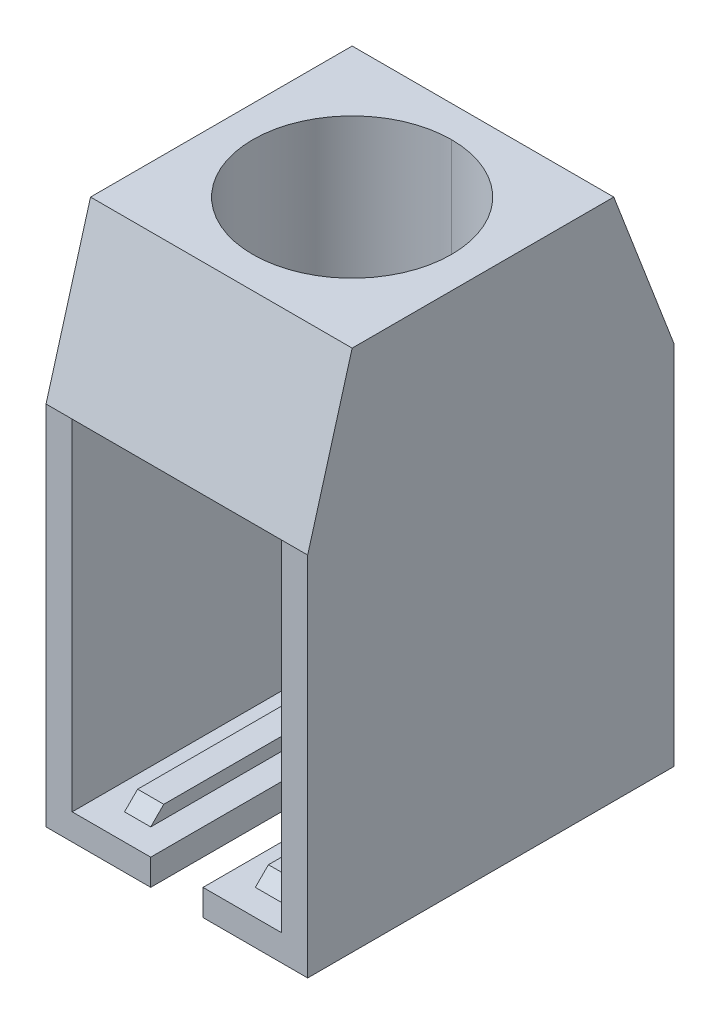
ISO-10303-21;
HEADER;
FILE_DESCRIPTION(('STEP AP214'),'2;1');
FILE_NAME('part.step','',(''),(''),'','','');
FILE_SCHEMA(('AUTOMOTIVE_DESIGN { 1 0 10303 214 1 1 1 1 }'));
ENDSEC;
DATA;
#1=APPLICATION_CONTEXT('core data for automotive mechanical design processes');
#2=APPLICATION_PROTOCOL_DEFINITION('international standard','automotive_design',2000,#1);
#3=PRODUCT_CONTEXT('',#1,'mechanical');
#4=PRODUCT('Part','Part','',(#3));
#5=PRODUCT_RELATED_PRODUCT_CATEGORY('part','',(#4));
#6=PRODUCT_DEFINITION_FORMATION('','',#4);
#7=PRODUCT_DEFINITION_CONTEXT('part definition',#1,'design');
#8=PRODUCT_DEFINITION('design','',#6,#7);
#9=PRODUCT_DEFINITION_SHAPE('','',#8);
#10=(LENGTH_UNIT() NAMED_UNIT(*) SI_UNIT(.MILLI.,.METRE.));
#11=(NAMED_UNIT(*) PLANE_ANGLE_UNIT() SI_UNIT($,.RADIAN.));
#12=(NAMED_UNIT(*) SI_UNIT($,.STERADIAN.) SOLID_ANGLE_UNIT());
#13=UNCERTAINTY_MEASURE_WITH_UNIT(LENGTH_MEASURE(1.E-05),#10,'distance_accuracy_value','');
#14=(GEOMETRIC_REPRESENTATION_CONTEXT(3) GLOBAL_UNCERTAINTY_ASSIGNED_CONTEXT((#13)) GLOBAL_UNIT_ASSIGNED_CONTEXT((#10,
#11,#12)) REPRESENTATION_CONTEXT('',''));
#15=CARTESIAN_POINT('',(0.,0.,0.));
#16=DIRECTION('',(0.,0.,1.));
#17=DIRECTION('',(1.,0.,0.));
#18=AXIS2_PLACEMENT_3D('',#15,#16,#17);
#19=CARTESIAN_POINT('',(-2.,6.5,3.));
#20=DIRECTION('',(0.,0.707106781186548,-0.707106781186547));
#21=DIRECTION('',(-1.,0.,0.));
#22=AXIS2_PLACEMENT_3D('',#19,#20,#21);
#23=PLANE('',#22);
#24=DIRECTION('',(0.,-0.707106781186547,-0.707106781186548));
#25=VECTOR('',#24,1.);
#26=CARTESIAN_POINT('',(2.,-0.355551275463989,-3.85555127546401));
#27=LINE('',#26,#25);
#28=CARTESIAN_POINT('',(2.,7.,3.5));
#29=VERTEX_POINT('',#28);
#30=CARTESIAN_POINT('',(2.,6.5,3.));
#31=VERTEX_POINT('',#30);
#32=EDGE_CURVE('E352',#29,#31,#27,.T.);
#33=ORIENTED_EDGE('',*,*,#32,.F.);
#34=DIRECTION('',(1.,0.,0.));
#35=VECTOR('',#34,1.);
#36=CARTESIAN_POINT('',(-2.5,7.,3.5));
#37=LINE('',#36,#35);
#38=CARTESIAN_POINT('',(-2.,7.,3.5));
#39=VERTEX_POINT('',#38);
#40=EDGE_CURVE('E348',#39,#29,#37,.T.);
#41=ORIENTED_EDGE('',*,*,#40,.F.);
#42=DIRECTION('',(0.,0.707106781186547,0.707106781186548));
#43=VECTOR('',#42,1.);
#44=CARTESIAN_POINT('',(-2.,-0.355551275463989,-3.85555127546401));
#45=LINE('',#44,#43);
#46=CARTESIAN_POINT('',(-2.,6.5,3.));
#47=VERTEX_POINT('',#46);
#48=EDGE_CURVE('E360',#47,#39,#45,.T.);
#49=ORIENTED_EDGE('',*,*,#48,.F.);
#50=DIRECTION('',(-1.,0.,0.));
#51=VECTOR('',#50,1.);
#52=CARTESIAN_POINT('',(-2.,6.5,3.));
#53=LINE('',#52,#51);
#54=EDGE_CURVE('E143',#31,#47,#53,.T.);
#55=ORIENTED_EDGE('',*,*,#54,.F.);
#56=EDGE_LOOP('',(#33,#41,#49,#55));
#57=FACE_BOUND('',#56,.T.);
#58=ADVANCED_FACE('F17',(#57),#23,.F.);
#59=CARTESIAN_POINT('',(0.,0.75,2.75));
#60=DIRECTION('',(0.,0.707106781186545,0.70710678118655));
#61=DIRECTION('',(1.,0.,0.));
#62=AXIS2_PLACEMENT_3D('',#59,#60,#61);
#63=PLANE('',#62);
#64=DIRECTION('',(0.,0.70710678118655,-0.707106781186545));
#65=VECTOR('',#64,1.);
#66=CARTESIAN_POINT('',(-1.5,0.749999999999976,2.75));
#67=LINE('',#66,#65);
#68=CARTESIAN_POINT('',(-1.5,0.5,3.));
#69=VERTEX_POINT('',#68);
#70=CARTESIAN_POINT('',(-1.5,0.75,2.75));
#71=VERTEX_POINT('',#70);
#72=EDGE_CURVE('E333',#69,#71,#67,.T.);
#73=ORIENTED_EDGE('',*,*,#72,.F.);
#74=DIRECTION('',(1.,0.,0.));
#75=VECTOR('',#74,1.);
#76=CARTESIAN_POINT('',(0.,0.5,3.));
#77=LINE('',#76,#75);
#78=CARTESIAN_POINT('',(-1.,0.5,3.));
#79=VERTEX_POINT('',#78);
#80=EDGE_CURVE('E537',#69,#79,#77,.T.);
#81=ORIENTED_EDGE('',*,*,#80,.T.);
#82=DIRECTION('',(0.,-0.70710678118655,0.707106781186545));
#83=VECTOR('',#82,1.);
#84=CARTESIAN_POINT('',(-1.,2.125,1.375));
#85=LINE('',#84,#83);
#86=CARTESIAN_POINT('',(-1.,0.75,2.75));
#87=VERTEX_POINT('',#86);
#88=EDGE_CURVE('E167',#87,#79,#85,.T.);
#89=ORIENTED_EDGE('',*,*,#88,.F.);
#90=DIRECTION('',(1.,0.,0.));
#91=VECTOR('',#90,1.);
#92=CARTESIAN_POINT('',(-1.,0.75,2.75));
#93=LINE('',#92,#91);
#94=EDGE_CURVE('E370',#71,#87,#93,.T.);
#95=ORIENTED_EDGE('',*,*,#94,.F.);
#96=EDGE_LOOP('',(#73,#81,#89,#95));
#97=FACE_BOUND('',#96,.T.);
#98=ADVANCED_FACE('F407',(#97),#63,.T.);
#99=CARTESIAN_POINT('',(0.,0.75,2.75));
#100=DIRECTION('',(0.,0.707106781186545,0.70710678118655));
#101=DIRECTION('',(1.,0.,0.));
#102=AXIS2_PLACEMENT_3D('',#99,#100,#101);
#103=PLANE('',#102);
#104=DIRECTION('',(0.,0.70710678118655,-0.707106781186545));
#105=VECTOR('',#104,1.);
#106=CARTESIAN_POINT('',(1.,0.75,2.75));
#107=LINE('',#106,#105);
#108=CARTESIAN_POINT('',(1.,0.5,3.));
#109=VERTEX_POINT('',#108);
#110=CARTESIAN_POINT('',(1.,0.75,2.75));
#111=VERTEX_POINT('',#110);
#112=EDGE_CURVE('E376',#109,#111,#107,.T.);
#113=ORIENTED_EDGE('',*,*,#112,.F.);
#114=DIRECTION('',(1.,0.,0.));
#115=VECTOR('',#114,1.);
#116=CARTESIAN_POINT('',(0.,0.5,3.));
#117=LINE('',#116,#115);
#118=CARTESIAN_POINT('',(1.5,0.5,3.));
#119=VERTEX_POINT('',#118);
#120=EDGE_CURVE('E526',#109,#119,#117,.T.);
#121=ORIENTED_EDGE('',*,*,#120,.T.);
#122=DIRECTION('',(0.,-0.70710678118655,0.707106781186545));
#123=VECTOR('',#122,1.);
#124=CARTESIAN_POINT('',(1.5,2.125,1.375));
#125=LINE('',#124,#123);
#126=CARTESIAN_POINT('',(1.5,0.75,2.75));
#127=VERTEX_POINT('',#126);
#128=EDGE_CURVE('E374',#127,#119,#125,.T.);
#129=ORIENTED_EDGE('',*,*,#128,.F.);
#130=DIRECTION('',(1.,0.,0.));
#131=VECTOR('',#130,1.);
#132=CARTESIAN_POINT('',(1.5,0.75,2.75));
#133=LINE('',#132,#131);
#134=EDGE_CURVE('E11',#111,#127,#133,.T.);
#135=ORIENTED_EDGE('',*,*,#134,.F.);
#136=EDGE_LOOP('',(#113,#121,#129,#135));
#137=FACE_BOUND('',#136,.T.);
#138=ADVANCED_FACE('F403',(#137),#103,.T.);
#139=CARTESIAN_POINT('',(0.,0.75,0.));
#140=DIRECTION('',(0.,1.,0.));
#141=DIRECTION('',(1.,0.,0.));
#142=AXIS2_PLACEMENT_3D('',#139,#140,#141);
#143=PLANE('',#142);
#144=DIRECTION('',(0.,0.,1.));
#145=VECTOR('',#144,1.);
#146=CARTESIAN_POINT('',(1.,0.75,0.));
#147=LINE('',#146,#145);
#148=CARTESIAN_POINT('',(1.,0.75,-3.));
#149=VERTEX_POINT('',#148);
#150=EDGE_CURVE('E20',#149,#111,#147,.T.);
#151=ORIENTED_EDGE('',*,*,#150,.T.);
#152=ORIENTED_EDGE('',*,*,#134,.T.);
#153=DIRECTION('',(0.,0.,1.));
#154=VECTOR('',#153,1.);
#155=CARTESIAN_POINT('',(1.5,0.75,0.));
#156=LINE('',#155,#154);
#157=CARTESIAN_POINT('',(1.5,0.75,-3.));
#158=VERTEX_POINT('',#157);
#159=EDGE_CURVE('E373',#158,#127,#156,.T.);
#160=ORIENTED_EDGE('',*,*,#159,.F.);
#161=DIRECTION('',(-1.,0.,0.));
#162=VECTOR('',#161,1.);
#163=CARTESIAN_POINT('',(0.,0.75,-3.));
#164=LINE('',#163,#162);
#165=EDGE_CURVE('E290',#158,#149,#164,.T.);
#166=ORIENTED_EDGE('',*,*,#165,.T.);
#167=EDGE_LOOP('',(#151,#152,#160,#166));
#168=FACE_BOUND('',#167,.T.);
#169=ADVANCED_FACE('F386',(#168),#143,.T.);
#170=CARTESIAN_POINT('',(1.,0.75,0.));
#171=DIRECTION('',(1.,0.,0.));
#172=DIRECTION('',(0.,0.,-1.));
#173=AXIS2_PLACEMENT_3D('',#170,#171,#172);
#174=PLANE('',#173);
#175=DIRECTION('',(0.,0.,1.));
#176=VECTOR('',#175,1.);
#177=CARTESIAN_POINT('',(1.,0.5,0.));
#178=LINE('',#177,#176);
#179=CARTESIAN_POINT('',(1.,0.5,-3.));
#180=VERTEX_POINT('',#179);
#181=EDGE_CURVE('E390',#180,#109,#178,.T.);
#182=ORIENTED_EDGE('',*,*,#181,.T.);
#183=ORIENTED_EDGE('',*,*,#112,.T.);
#184=ORIENTED_EDGE('',*,*,#150,.F.);
#185=DIRECTION('',(0.,-1.,0.));
#186=VECTOR('',#185,1.);
#187=CARTESIAN_POINT('',(1.,0.75,-3.));
#188=LINE('',#187,#186);
#189=EDGE_CURVE('E191',#149,#180,#188,.T.);
#190=ORIENTED_EDGE('',*,*,#189,.T.);
#191=EDGE_LOOP('',(#182,#183,#184,#190));
#192=FACE_BOUND('',#191,.T.);
#193=ADVANCED_FACE('F388',(#192),#174,.F.);
#194=CARTESIAN_POINT('',(1.5,0.75,0.));
#195=DIRECTION('',(1.,0.,0.));
#196=DIRECTION('',(0.,0.,-1.));
#197=AXIS2_PLACEMENT_3D('',#194,#195,#196);
#198=PLANE('',#197);
#199=ORIENTED_EDGE('',*,*,#159,.T.);
#200=ORIENTED_EDGE('',*,*,#128,.T.);
#201=DIRECTION('',(0.,0.,1.));
#202=VECTOR('',#201,1.);
#203=CARTESIAN_POINT('',(1.5,0.5,0.));
#204=LINE('',#203,#202);
#205=CARTESIAN_POINT('',(1.5,0.5,-3.));
#206=VERTEX_POINT('',#205);
#207=EDGE_CURVE('E475',#206,#119,#204,.T.);
#208=ORIENTED_EDGE('',*,*,#207,.F.);
#209=DIRECTION('',(0.,-1.,0.));
#210=VECTOR('',#209,1.);
#211=CARTESIAN_POINT('',(1.5,0.75,-3.));
#212=LINE('',#211,#210);
#213=EDGE_CURVE('E571',#158,#206,#212,.T.);
#214=ORIENTED_EDGE('',*,*,#213,.F.);
#215=EDGE_LOOP('',(#199,#200,#208,#214));
#216=FACE_BOUND('',#215,.T.);
#217=ADVANCED_FACE('F393',(#216),#198,.T.);
#218=CARTESIAN_POINT('',(0.,0.75,0.));
#219=DIRECTION('',(0.,1.,0.));
#220=DIRECTION('',(1.,0.,0.));
#221=AXIS2_PLACEMENT_3D('',#218,#219,#220);
#222=PLANE('',#221);
#223=DIRECTION('',(0.,0.,1.));
#224=VECTOR('',#223,1.);
#225=CARTESIAN_POINT('',(-1.5,0.75,0.));
#226=LINE('',#225,#224);
#227=CARTESIAN_POINT('',(-1.5,0.75,-3.));
#228=VERTEX_POINT('',#227);
#229=EDGE_CURVE('E328',#228,#71,#226,.T.);
#230=ORIENTED_EDGE('',*,*,#229,.T.);
#231=ORIENTED_EDGE('',*,*,#94,.T.);
#232=DIRECTION('',(0.,0.,1.));
#233=VECTOR('',#232,1.);
#234=CARTESIAN_POINT('',(-1.,0.75,0.));
#235=LINE('',#234,#233);
#236=CARTESIAN_POINT('',(-1.,0.75,-3.));
#237=VERTEX_POINT('',#236);
#238=EDGE_CURVE('E332',#237,#87,#235,.T.);
#239=ORIENTED_EDGE('',*,*,#238,.F.);
#240=DIRECTION('',(-1.,0.,0.));
#241=VECTOR('',#240,1.);
#242=CARTESIAN_POINT('',(0.,0.75,-3.));
#243=LINE('',#242,#241);
#244=EDGE_CURVE('E454',#237,#228,#243,.T.);
#245=ORIENTED_EDGE('',*,*,#244,.T.);
#246=EDGE_LOOP('',(#230,#231,#239,#245));
#247=FACE_BOUND('',#246,.T.);
#248=ADVANCED_FACE('F400',(#247),#222,.T.);
#249=CARTESIAN_POINT('',(-1.,0.75,0.));
#250=DIRECTION('',(1.,0.,0.));
#251=DIRECTION('',(0.,0.,1.));
#252=AXIS2_PLACEMENT_3D('',#249,#250,#251);
#253=PLANE('',#252);
#254=ORIENTED_EDGE('',*,*,#238,.T.);
#255=ORIENTED_EDGE('',*,*,#88,.T.);
#256=DIRECTION('',(0.,0.,1.));
#257=VECTOR('',#256,1.);
#258=CARTESIAN_POINT('',(-1.,0.5,0.));
#259=LINE('',#258,#257);
#260=CARTESIAN_POINT('',(-1.,0.5,-3.));
#261=VERTEX_POINT('',#260);
#262=EDGE_CURVE('E530',#261,#79,#259,.T.);
#263=ORIENTED_EDGE('',*,*,#262,.F.);
#264=DIRECTION('',(0.,-1.,0.));
#265=VECTOR('',#264,1.);
#266=CARTESIAN_POINT('',(-1.,0.75,-3.));
#267=LINE('',#266,#265);
#268=EDGE_CURVE('E179',#237,#261,#267,.T.);
#269=ORIENTED_EDGE('',*,*,#268,.F.);
#270=EDGE_LOOP('',(#254,#255,#263,#269));
#271=FACE_BOUND('',#270,.T.);
#272=ADVANCED_FACE('F654',(#271),#253,.T.);
#273=CARTESIAN_POINT('',(-1.5,0.75,0.));
#274=DIRECTION('',(1.,0.,0.));
#275=DIRECTION('',(0.,0.,-1.));
#276=AXIS2_PLACEMENT_3D('',#273,#274,#275);
#277=PLANE('',#276);
#278=DIRECTION('',(0.,0.,1.));
#279=VECTOR('',#278,1.);
#280=CARTESIAN_POINT('',(-1.5,0.5,0.));
#281=LINE('',#280,#279);
#282=CARTESIAN_POINT('',(-1.5,0.5,-3.));
#283=VERTEX_POINT('',#282);
#284=EDGE_CURVE('E540',#283,#69,#281,.T.);
#285=ORIENTED_EDGE('',*,*,#284,.T.);
#286=ORIENTED_EDGE('',*,*,#72,.T.);
#287=ORIENTED_EDGE('',*,*,#229,.F.);
#288=DIRECTION('',(0.,-1.,0.));
#289=VECTOR('',#288,1.);
#290=CARTESIAN_POINT('',(-1.5,0.75,-3.));
#291=LINE('',#290,#289);
#292=EDGE_CURVE('E451',#228,#283,#291,.T.);
#293=ORIENTED_EDGE('',*,*,#292,.T.);
#294=EDGE_LOOP('',(#285,#286,#287,#293));
#295=FACE_BOUND('',#294,.T.);
#296=ADVANCED_FACE('F605',(#295),#277,.F.);
#297=CARTESIAN_POINT('',(-0.5,10.001,3.5));
#298=DIRECTION('',(-1.,0.,0.));
#299=DIRECTION('',(0.,0.,1.));
#300=AXIS2_PLACEMENT_3D('',#297,#298,#299);
#301=PLANE('',#300);
#302=DIRECTION('',(0.,0.,1.));
#303=VECTOR('',#302,1.);
#304=CARTESIAN_POINT('',(-0.5,0.5,3.5));
#305=LINE('',#304,#303);
#306=CARTESIAN_POINT('',(-0.5,0.5,0.15));
#307=VERTEX_POINT('',#306);
#308=CARTESIAN_POINT('',(-0.5,0.5,3.5));
#309=VERTEX_POINT('',#308);
#310=EDGE_CURVE('E556',#307,#309,#305,.T.);
#311=ORIENTED_EDGE('',*,*,#310,.T.);
#312=DIRECTION('',(0.,-1.,0.));
#313=VECTOR('',#312,1.);
#314=CARTESIAN_POINT('',(-0.5,10.001,3.5));
#315=LINE('',#314,#313);
#316=CARTESIAN_POINT('',(-0.5,0.,3.5));
#317=VERTEX_POINT('',#316);
#318=EDGE_CURVE('E483',#309,#317,#315,.T.);
#319=ORIENTED_EDGE('',*,*,#318,.T.);
#320=DIRECTION('',(0.,0.,-1.));
#321=VECTOR('',#320,1.);
#322=CARTESIAN_POINT('',(-0.5,0.,3.5));
#323=LINE('',#322,#321);
#324=CARTESIAN_POINT('',(-0.5,0.,0.15));
#325=VERTEX_POINT('',#324);
#326=EDGE_CURVE('E344',#317,#325,#323,.T.);
#327=ORIENTED_EDGE('',*,*,#326,.T.);
#328=DIRECTION('',(0.,-1.,0.));
#329=VECTOR('',#328,1.);
#330=CARTESIAN_POINT('',(-0.5,10.001,0.15));
#331=LINE('',#330,#329);
#332=EDGE_CURVE('E367',#307,#325,#331,.T.);
#333=ORIENTED_EDGE('',*,*,#332,.F.);
#334=EDGE_LOOP('',(#311,#319,#327,#333));
#335=FACE_BOUND('',#334,.T.);
#336=ADVANCED_FACE('F601',(#335),#301,.F.);
#337=CARTESIAN_POINT('',(0.,10.001,0.15));
#338=DIRECTION('',(0.,-1.,0.));
#339=DIRECTION('',(0.,0.,-1.));
#340=AXIS2_PLACEMENT_3D('',#337,#338,#339);
#341=CYLINDRICAL_SURFACE('',#340,0.5);
#342=DIRECTION('',(0.,-1.,0.));
#343=VECTOR('',#342,1.);
#344=CARTESIAN_POINT('',(0.,10.001,-0.35));
#345=LINE('',#344,#343);
#346=CARTESIAN_POINT('',(0.,0.5,-0.35));
#347=VERTEX_POINT('',#346);
#348=CARTESIAN_POINT('',(0.,0.,-0.35));
#349=VERTEX_POINT('',#348);
#350=EDGE_CURVE('E676',#347,#349,#345,.T.);
#351=ORIENTED_EDGE('',*,*,#350,.F.);
#352=CARTESIAN_POINT('',(0.,0.5,0.15));
#353=DIRECTION('',(0.,1.,0.));
#354=DIRECTION('',(0.,0.,-1.));
#355=AXIS2_PLACEMENT_3D('',#352,#353,#354);
#356=CIRCLE('',#355,0.5);
#357=EDGE_CURVE('E562',#347,#307,#356,.T.);
#358=ORIENTED_EDGE('',*,*,#357,.T.);
#359=ORIENTED_EDGE('',*,*,#332,.T.);
#360=CARTESIAN_POINT('',(0.,0.,0.15));
#361=DIRECTION('',(0.,-1.,0.));
#362=DIRECTION('',(0.,0.,-1.));
#363=AXIS2_PLACEMENT_3D('',#360,#361,#362);
#364=CIRCLE('',#363,0.5);
#365=EDGE_CURVE('E341',#325,#349,#364,.T.);
#366=ORIENTED_EDGE('',*,*,#365,.T.);
#367=EDGE_LOOP('',(#351,#358,#359,#366));
#368=FACE_BOUND('',#367,.T.);
#369=ADVANCED_FACE('F604',(#368),#341,.F.);
#370=CARTESIAN_POINT('',(0.5,10.001,0.15));
#371=DIRECTION('',(1.,0.,0.));
#372=DIRECTION('',(0.,0.,1.));
#373=AXIS2_PLACEMENT_3D('',#370,#371,#372);
#374=PLANE('',#373);
#375=DIRECTION('',(0.,0.,-1.));
#376=VECTOR('',#375,1.);
#377=CARTESIAN_POINT('',(0.5,0.5,0.15));
#378=LINE('',#377,#376);
#379=CARTESIAN_POINT('',(0.5,0.5,3.5));
#380=VERTEX_POINT('',#379);
#381=CARTESIAN_POINT('',(0.5,0.5,0.15));
#382=VERTEX_POINT('',#381);
#383=EDGE_CURVE('E557',#380,#382,#378,.T.);
#384=ORIENTED_EDGE('',*,*,#383,.T.);
#385=DIRECTION('',(0.,-1.,0.));
#386=VECTOR('',#385,1.);
#387=CARTESIAN_POINT('',(0.5,10.001,0.15));
#388=LINE('',#387,#386);
#389=CARTESIAN_POINT('',(0.5,0.,0.15));
#390=VERTEX_POINT('',#389);
#391=EDGE_CURVE('E484',#382,#390,#388,.T.);
#392=ORIENTED_EDGE('',*,*,#391,.T.);
#393=DIRECTION('',(0.,0.,1.));
#394=VECTOR('',#393,1.);
#395=CARTESIAN_POINT('',(0.5,0.,0.15));
#396=LINE('',#395,#394);
#397=CARTESIAN_POINT('',(0.5,0.,3.5));
#398=VERTEX_POINT('',#397);
#399=EDGE_CURVE('E338',#390,#398,#396,.T.);
#400=ORIENTED_EDGE('',*,*,#399,.T.);
#401=DIRECTION('',(0.,-1.,0.));
#402=VECTOR('',#401,1.);
#403=CARTESIAN_POINT('',(0.5,10.001,3.5));
#404=LINE('',#403,#402);
#405=EDGE_CURVE('E310',#380,#398,#404,.T.);
#406=ORIENTED_EDGE('',*,*,#405,.F.);
#407=EDGE_LOOP('',(#384,#392,#400,#406));
#408=FACE_BOUND('',#407,.T.);
#409=ADVANCED_FACE('F617',(#408),#374,.F.);
#410=CARTESIAN_POINT('',(0.,-0.000999999999999265,0.15));
#411=DIRECTION('',(0.,1.,0.));
#412=DIRECTION('',(0.,0.,1.));
#413=AXIS2_PLACEMENT_3D('',#410,#411,#412);
#414=CYLINDRICAL_SURFACE('',#413,1.9);
#415=DIRECTION('',(0.,1.,0.));
#416=VECTOR('',#415,1.);
#417=CARTESIAN_POINT('',(0.,-0.000999999999999265,-1.75));
#418=LINE('',#417,#416);
#419=CARTESIAN_POINT('',(0.,6.5,-1.75));
#420=VERTEX_POINT('',#419);
#421=CARTESIAN_POINT('',(0.,10.,-1.75));
#422=VERTEX_POINT('',#421);
#423=EDGE_CURVE('E492',#420,#422,#418,.T.);
#424=ORIENTED_EDGE('',*,*,#423,.F.);
#425=CARTESIAN_POINT('',(0.,6.5,0.15));
#426=DIRECTION('',(0.,-1.,0.));
#427=DIRECTION('',(0.,0.,1.));
#428=AXIS2_PLACEMENT_3D('',#425,#426,#427);
#429=CIRCLE('',#428,1.9);
#430=CARTESIAN_POINT('',(0.,6.5,2.05));
#431=VERTEX_POINT('',#430);
#432=EDGE_CURVE('E363',#420,#431,#429,.T.);
#433=ORIENTED_EDGE('',*,*,#432,.T.);
#434=DIRECTION('',(0.,1.,0.));
#435=VECTOR('',#434,1.);
#436=CARTESIAN_POINT('',(0.,-0.000999999999999265,2.05));
#437=LINE('',#436,#435);
#438=CARTESIAN_POINT('',(0.,10.,2.05));
#439=VERTEX_POINT('',#438);
#440=EDGE_CURVE('E497',#431,#439,#437,.T.);
#441=ORIENTED_EDGE('',*,*,#440,.T.);
#442=CARTESIAN_POINT('',(0.,10.,0.15));
#443=DIRECTION('',(0.,1.,0.));
#444=DIRECTION('',(0.,0.,1.));
#445=AXIS2_PLACEMENT_3D('',#442,#443,#444);
#446=CIRCLE('',#445,1.9);
#447=EDGE_CURVE('E268',#439,#422,#446,.T.);
#448=ORIENTED_EDGE('',*,*,#447,.T.);
#449=EDGE_LOOP('',(#424,#433,#441,#448));
#450=FACE_BOUND('',#449,.T.);
#451=ADVANCED_FACE('F644',(#450),#414,.F.);
#452=CARTESIAN_POINT('',(-2.,6.5,-10.711102550928));
#453=DIRECTION('',(0.,1.,0.));
#454=DIRECTION('',(1.,0.,0.));
#455=AXIS2_PLACEMENT_3D('',#452,#453,#454);
#456=PLANE('',#455);
#457=CARTESIAN_POINT('',(0.,6.5,0.15));
#458=DIRECTION('',(0.,-1.,0.));
#459=DIRECTION('',(0.,0.,1.));
#460=AXIS2_PLACEMENT_3D('',#457,#458,#459);
#461=CIRCLE('',#460,1.9);
#462=EDGE_CURVE('E488',#431,#420,#461,.T.);
#463=ORIENTED_EDGE('',*,*,#462,.F.);
#464=ORIENTED_EDGE('',*,*,#432,.F.);
#465=EDGE_LOOP('',(#463,#464));
#466=FACE_BOUND('',#465,.T.);
#467=DIRECTION('',(0.,0.,1.));
#468=VECTOR('',#467,1.);
#469=CARTESIAN_POINT('',(2.,6.5,-10.711102550928));
#470=LINE('',#469,#468);
#471=CARTESIAN_POINT('',(2.,6.5,-3.));
#472=VERTEX_POINT('',#471);
#473=EDGE_CURVE('E294',#472,#31,#470,.T.);
#474=ORIENTED_EDGE('',*,*,#473,.T.);
#475=ORIENTED_EDGE('',*,*,#54,.T.);
#476=DIRECTION('',(0.,0.,1.));
#477=VECTOR('',#476,1.);
#478=CARTESIAN_POINT('',(-2.,6.5,-10.711102550928));
#479=LINE('',#478,#477);
#480=CARTESIAN_POINT('',(-2.,6.5,-3.));
#481=VERTEX_POINT('',#480);
#482=EDGE_CURVE('E356',#481,#47,#479,.T.);
#483=ORIENTED_EDGE('',*,*,#482,.F.);
#484=DIRECTION('',(1.,0.,0.));
#485=VECTOR('',#484,1.);
#486=CARTESIAN_POINT('',(-2.,6.5,-3.));
#487=LINE('',#486,#485);
#488=EDGE_CURVE('E443',#481,#472,#487,.T.);
#489=ORIENTED_EDGE('',*,*,#488,.T.);
#490=EDGE_LOOP('',(#474,#475,#483,#489));
#491=FACE_BOUND('',#490,.T.);
#492=ADVANCED_FACE('F621',(#466,#491),#456,.F.);
#493=CARTESIAN_POINT('',(-2.,6.5,-10.711102550928));
#494=DIRECTION('',(-1.,0.,0.));
#495=DIRECTION('',(0.,0.,1.));
#496=AXIS2_PLACEMENT_3D('',#493,#494,#495);
#497=PLANE('',#496);
#498=DIRECTION('',(0.,1.,0.));
#499=VECTOR('',#498,1.);
#500=CARTESIAN_POINT('',(-2.,6.5,-3.));
#501=LINE('',#500,#499);
#502=CARTESIAN_POINT('',(-2.,0.5,-3.));
#503=VERTEX_POINT('',#502);
#504=EDGE_CURVE('E447',#503,#481,#501,.T.);
#505=ORIENTED_EDGE('',*,*,#504,.T.);
#506=ORIENTED_EDGE('',*,*,#482,.T.);
#507=ORIENTED_EDGE('',*,*,#48,.T.);
#508=DIRECTION('',(0.,-1.,0.));
#509=VECTOR('',#508,1.);
#510=CARTESIAN_POINT('',(-2.,6.5,3.5));
#511=LINE('',#510,#509);
#512=CARTESIAN_POINT('',(-2.,0.5,3.5));
#513=VERTEX_POINT('',#512);
#514=EDGE_CURVE('E509',#39,#513,#511,.T.);
#515=ORIENTED_EDGE('',*,*,#514,.T.);
#516=DIRECTION('',(0.,0.,1.));
#517=VECTOR('',#516,1.);
#518=CARTESIAN_POINT('',(-2.,0.5,-10.711102550928));
#519=LINE('',#518,#517);
#520=EDGE_CURVE('E551',#503,#513,#519,.T.);
#521=ORIENTED_EDGE('',*,*,#520,.F.);
#522=EDGE_LOOP('',(#505,#506,#507,#515,#521));
#523=FACE_BOUND('',#522,.T.);
#524=ADVANCED_FACE('F619',(#523),#497,.F.);
#525=CARTESIAN_POINT('',(2.,6.5,-10.711102550928));
#526=DIRECTION('',(1.,0.,0.));
#527=DIRECTION('',(0.,1.,0.));
#528=AXIS2_PLACEMENT_3D('',#525,#526,#527);
#529=PLANE('',#528);
#530=DIRECTION('',(0.,-1.,0.));
#531=VECTOR('',#530,1.);
#532=CARTESIAN_POINT('',(2.,6.5,-3.));
#533=LINE('',#532,#531);
#534=CARTESIAN_POINT('',(2.,0.5,-3.));
#535=VERTEX_POINT('',#534);
#536=EDGE_CURVE('E441',#472,#535,#533,.T.);
#537=ORIENTED_EDGE('',*,*,#536,.T.);
#538=DIRECTION('',(0.,0.,1.));
#539=VECTOR('',#538,1.);
#540=CARTESIAN_POINT('',(2.,0.5,-10.711102550928));
#541=LINE('',#540,#539);
#542=CARTESIAN_POINT('',(2.,0.5,3.5));
#543=VERTEX_POINT('',#542);
#544=EDGE_CURVE('E427',#535,#543,#541,.T.);
#545=ORIENTED_EDGE('',*,*,#544,.T.);
#546=DIRECTION('',(0.,1.,0.));
#547=VECTOR('',#546,1.);
#548=CARTESIAN_POINT('',(2.,6.5,3.5));
#549=LINE('',#548,#547);
#550=EDGE_CURVE('E424',#543,#29,#549,.T.);
#551=ORIENTED_EDGE('',*,*,#550,.T.);
#552=ORIENTED_EDGE('',*,*,#32,.T.);
#553=ORIENTED_EDGE('',*,*,#473,.F.);
#554=EDGE_LOOP('',(#537,#545,#551,#552,#553));
#555=FACE_BOUND('',#554,.T.);
#556=ADVANCED_FACE('F425',(#555),#529,.F.);
#557=CARTESIAN_POINT('',(-2.5,7.,3.5));
#558=DIRECTION('',(0.,-0.272602572456025,-0.962126726315384));
#559=DIRECTION('',(0.,-0.962126726315384,0.272602572456025));
#560=AXIS2_PLACEMENT_3D('',#557,#558,#559);
#561=PLANE('',#560);
#562=DIRECTION('',(0.,0.962126726315384,-0.272602572456025));
#563=VECTOR('',#562,1.);
#564=CARTESIAN_POINT('',(2.5,7.,3.5));
#565=LINE('',#564,#563);
#566=CARTESIAN_POINT('',(2.5,7.,3.5));
#567=VERTEX_POINT('',#566);
#568=CARTESIAN_POINT('',(2.5,10.,2.65));
#569=VERTEX_POINT('',#568);
#570=EDGE_CURVE('E316',#567,#569,#565,.T.);
#571=ORIENTED_EDGE('',*,*,#570,.T.);
#572=DIRECTION('',(1.,0.,0.));
#573=VECTOR('',#572,1.);
#574=CARTESIAN_POINT('',(-2.5,10.,2.65));
#575=LINE('',#574,#573);
#576=CARTESIAN_POINT('',(-2.5,10.,2.65));
#577=VERTEX_POINT('',#576);
#578=EDGE_CURVE('E269',#577,#569,#575,.T.);
#579=ORIENTED_EDGE('',*,*,#578,.F.);
#580=DIRECTION('',(0.,0.962126726315384,-0.272602572456025));
#581=VECTOR('',#580,1.);
#582=CARTESIAN_POINT('',(-2.5,7.,3.5));
#583=LINE('',#582,#581);
#584=CARTESIAN_POINT('',(-2.5,7.,3.5));
#585=VERTEX_POINT('',#584);
#586=EDGE_CURVE('E283',#585,#577,#583,.T.);
#587=ORIENTED_EDGE('',*,*,#586,.F.);
#588=DIRECTION('',(1.,0.,0.));
#589=VECTOR('',#588,1.);
#590=CARTESIAN_POINT('',(-2.5,7.,3.5));
#591=LINE('',#590,#589);
#592=EDGE_CURVE('E421',#585,#39,#591,.T.);
#593=ORIENTED_EDGE('',*,*,#592,.T.);
#594=ORIENTED_EDGE('',*,*,#40,.T.);
#595=DIRECTION('',(1.,0.,0.));
#596=VECTOR('',#595,1.);
#597=CARTESIAN_POINT('',(-2.5,7.,3.5));
#598=LINE('',#597,#596);
#599=EDGE_CURVE('E304',#29,#567,#598,.T.);
#600=ORIENTED_EDGE('',*,*,#599,.T.);
#601=EDGE_LOOP('',(#571,#579,#587,#593,#594,#600));
#602=FACE_BOUND('',#601,.T.);
#603=ADVANCED_FACE('F418',(#602),#561,.F.);
#604=CARTESIAN_POINT('',(-2.5,7.,-3.5));
#605=DIRECTION('',(0.,-0.357936011632452,0.93374611730205));
#606=DIRECTION('',(-1.,0.,0.));
#607=AXIS2_PLACEMENT_3D('',#604,#605,#606);
#608=PLANE('',#607);
#609=DIRECTION('',(0.,-0.93374611730205,-0.357936011632452));
#610=VECTOR('',#609,1.);
#611=CARTESIAN_POINT('',(2.5,7.,-3.5));
#612=LINE('',#611,#610);
#613=CARTESIAN_POINT('',(2.5,10.,-2.35));
#614=VERTEX_POINT('',#613);
#615=CARTESIAN_POINT('',(2.5,7.,-3.5));
#616=VERTEX_POINT('',#615);
#617=EDGE_CURVE('E325',#614,#616,#612,.T.);
#618=ORIENTED_EDGE('',*,*,#617,.T.);
#619=DIRECTION('',(1.,0.,0.));
#620=VECTOR('',#619,1.);
#621=CARTESIAN_POINT('',(-2.5,7.,-3.5));
#622=LINE('',#621,#620);
#623=CARTESIAN_POINT('',(-2.5,7.,-3.5));
#624=VERTEX_POINT('',#623);
#625=EDGE_CURVE('E274',#624,#616,#622,.T.);
#626=ORIENTED_EDGE('',*,*,#625,.F.);
#627=DIRECTION('',(0.,-0.93374611730205,-0.357936011632452));
#628=VECTOR('',#627,1.);
#629=CARTESIAN_POINT('',(-2.5,7.,-3.5));
#630=LINE('',#629,#628);
#631=CARTESIAN_POINT('',(-2.5,10.,-2.35));
#632=VERTEX_POINT('',#631);
#633=EDGE_CURVE('E272',#632,#624,#630,.T.);
#634=ORIENTED_EDGE('',*,*,#633,.F.);
#635=DIRECTION('',(1.,0.,0.));
#636=VECTOR('',#635,1.);
#637=CARTESIAN_POINT('',(-2.5,10.,-2.35));
#638=LINE('',#637,#636);
#639=EDGE_CURVE('E256',#632,#614,#638,.T.);
#640=ORIENTED_EDGE('',*,*,#639,.T.);
#641=EDGE_LOOP('',(#618,#626,#634,#640));
#642=FACE_BOUND('',#641,.T.);
#643=ADVANCED_FACE('F273',(#642),#608,.F.);
#644=CARTESIAN_POINT('',(0.,0.,0.));
#645=DIRECTION('',(0.,-1.,0.));
#646=DIRECTION('',(0.,0.,-1.));
#647=AXIS2_PLACEMENT_3D('',#644,#645,#646);
#648=PLANE('',#647);
#649=ORIENTED_EDGE('',*,*,#399,.F.);
#650=CARTESIAN_POINT('',(0.,0.,0.15));
#651=DIRECTION('',(0.,-1.,0.));
#652=DIRECTION('',(0.,0.,-1.));
#653=AXIS2_PLACEMENT_3D('',#650,#651,#652);
#654=CIRCLE('',#653,0.5);
#655=EDGE_CURVE('E469',#349,#390,#654,.T.);
#656=ORIENTED_EDGE('',*,*,#655,.F.);
#657=ORIENTED_EDGE('',*,*,#365,.F.);
#658=ORIENTED_EDGE('',*,*,#326,.F.);
#659=DIRECTION('',(1.,0.,0.));
#660=VECTOR('',#659,1.);
#661=CARTESIAN_POINT('',(2.5,0.,3.5));
#662=LINE('',#661,#660);
#663=CARTESIAN_POINT('',(-2.5,0.,3.5));
#664=VERTEX_POINT('',#663);
#665=EDGE_CURVE('E513',#664,#317,#662,.T.);
#666=ORIENTED_EDGE('',*,*,#665,.F.);
#667=DIRECTION('',(0.,0.,1.));
#668=VECTOR('',#667,1.);
#669=CARTESIAN_POINT('',(-2.5,0.,-3.5));
#670=LINE('',#669,#668);
#671=CARTESIAN_POINT('',(-2.5,0.,-3.5));
#672=VERTEX_POINT('',#671);
#673=EDGE_CURVE('E300',#672,#664,#670,.T.);
#674=ORIENTED_EDGE('',*,*,#673,.F.);
#675=DIRECTION('',(-1.,0.,0.));
#676=VECTOR('',#675,1.);
#677=CARTESIAN_POINT('',(2.5,0.,-3.5));
#678=LINE('',#677,#676);
#679=CARTESIAN_POINT('',(2.5,0.,-3.5));
#680=VERTEX_POINT('',#679);
#681=EDGE_CURVE('E295',#680,#672,#678,.T.);
#682=ORIENTED_EDGE('',*,*,#681,.F.);
#683=DIRECTION('',(0.,0.,-1.));
#684=VECTOR('',#683,1.);
#685=CARTESIAN_POINT('',(2.5,0.,-3.5));
#686=LINE('',#685,#684);
#687=CARTESIAN_POINT('',(2.5,0.,3.5));
#688=VERTEX_POINT('',#687);
#689=EDGE_CURVE('E320',#688,#680,#686,.T.);
#690=ORIENTED_EDGE('',*,*,#689,.F.);
#691=DIRECTION('',(1.,0.,0.));
#692=VECTOR('',#691,1.);
#693=CARTESIAN_POINT('',(2.5,0.,3.5));
#694=LINE('',#693,#692);
#695=EDGE_CURVE('E305',#398,#688,#694,.T.);
#696=ORIENTED_EDGE('',*,*,#695,.F.);
#697=EDGE_LOOP('',(#649,#656,#657,#658,#666,#674,#682,#690,#696));
#698=FACE_BOUND('',#697,.T.);
#699=ADVANCED_FACE('F631',(#698),#648,.T.);
#700=CARTESIAN_POINT('',(0.,10.,0.));
#701=DIRECTION('',(0.,-1.,0.));
#702=DIRECTION('',(0.,0.,-1.));
#703=AXIS2_PLACEMENT_3D('',#700,#701,#702);
#704=PLANE('',#703);
#705=ORIENTED_EDGE('',*,*,#447,.F.);
#706=CARTESIAN_POINT('',(0.,10.,0.15));
#707=DIRECTION('',(0.,1.,0.));
#708=DIRECTION('',(0.,0.,1.));
#709=AXIS2_PLACEMENT_3D('',#706,#707,#708);
#710=CIRCLE('',#709,1.9);
#711=EDGE_CURVE('E493',#422,#439,#710,.T.);
#712=ORIENTED_EDGE('',*,*,#711,.F.);
#713=EDGE_LOOP('',(#705,#712));
#714=FACE_BOUND('',#713,.T.);
#715=DIRECTION('',(0.,0.,1.));
#716=VECTOR('',#715,1.);
#717=CARTESIAN_POINT('',(-2.5,10.,-3.5));
#718=LINE('',#717,#716);
#719=EDGE_CURVE('E260',#632,#577,#718,.T.);
#720=ORIENTED_EDGE('',*,*,#719,.T.);
#721=ORIENTED_EDGE('',*,*,#578,.T.);
#722=DIRECTION('',(0.,0.,-1.));
#723=VECTOR('',#722,1.);
#724=CARTESIAN_POINT('',(2.5,10.,-3.5));
#725=LINE('',#724,#723);
#726=EDGE_CURVE('E263',#569,#614,#725,.T.);
#727=ORIENTED_EDGE('',*,*,#726,.T.);
#728=ORIENTED_EDGE('',*,*,#639,.F.);
#729=EDGE_LOOP('',(#720,#721,#727,#728));
#730=FACE_BOUND('',#729,.T.);
#731=ADVANCED_FACE('F258',(#714,#730),#704,.F.);
#732=CARTESIAN_POINT('',(2.5,10.,-3.5));
#733=DIRECTION('',(0.,0.,1.));
#734=DIRECTION('',(1.,0.,0.));
#735=AXIS2_PLACEMENT_3D('',#732,#733,#734);
#736=PLANE('',#735);
#737=DIRECTION('',(0.,-1.,0.));
#738=VECTOR('',#737,1.);
#739=CARTESIAN_POINT('',(-2.5,10.,-3.5));
#740=LINE('',#739,#738);
#741=EDGE_CURVE('E279',#624,#672,#740,.T.);
#742=ORIENTED_EDGE('',*,*,#741,.F.);
#743=ORIENTED_EDGE('',*,*,#625,.T.);
#744=DIRECTION('',(0.,-1.,0.));
#745=VECTOR('',#744,1.);
#746=CARTESIAN_POINT('',(2.5,10.,-3.5));
#747=LINE('',#746,#745);
#748=EDGE_CURVE('E324',#616,#680,#747,.T.);
#749=ORIENTED_EDGE('',*,*,#748,.T.);
#750=ORIENTED_EDGE('',*,*,#681,.T.);
#751=EDGE_LOOP('',(#742,#743,#749,#750));
#752=FACE_BOUND('',#751,.T.);
#753=ADVANCED_FACE('F610',(#752),#736,.F.);
#754=CARTESIAN_POINT('',(2.5,10.,-3.5));
#755=DIRECTION('',(-1.,0.,0.));
#756=DIRECTION('',(0.,1.,0.));
#757=AXIS2_PLACEMENT_3D('',#754,#755,#756);
#758=PLANE('',#757);
#759=ORIENTED_EDGE('',*,*,#726,.F.);
#760=ORIENTED_EDGE('',*,*,#570,.F.);
#761=DIRECTION('',(0.,-1.,0.));
#762=VECTOR('',#761,1.);
#763=CARTESIAN_POINT('',(2.5,10.,3.5));
#764=LINE('',#763,#762);
#765=EDGE_CURVE('E309',#567,#688,#764,.T.);
#766=ORIENTED_EDGE('',*,*,#765,.T.);
#767=ORIENTED_EDGE('',*,*,#689,.T.);
#768=ORIENTED_EDGE('',*,*,#748,.F.);
#769=ORIENTED_EDGE('',*,*,#617,.F.);
#770=EDGE_LOOP('',(#759,#760,#766,#767,#768,#769));
#771=FACE_BOUND('',#770,.T.);
#772=ADVANCED_FACE('F612',(#771),#758,.F.);
#773=CARTESIAN_POINT('',(2.5,10.,3.5));
#774=DIRECTION('',(0.,0.,-1.));
#775=DIRECTION('',(-1.,0.,0.));
#776=AXIS2_PLACEMENT_3D('',#773,#774,#775);
#777=PLANE('',#776);
#778=ORIENTED_EDGE('',*,*,#599,.F.);
#779=ORIENTED_EDGE('',*,*,#550,.F.);
#780=DIRECTION('',(1.,0.,0.));
#781=VECTOR('',#780,1.);
#782=CARTESIAN_POINT('',(-2.,0.5,3.5));
#783=LINE('',#782,#781);
#784=EDGE_CURVE('E561',#380,#543,#783,.T.);
#785=ORIENTED_EDGE('',*,*,#784,.F.);
#786=ORIENTED_EDGE('',*,*,#405,.T.);
#787=ORIENTED_EDGE('',*,*,#695,.T.);
#788=ORIENTED_EDGE('',*,*,#765,.F.);
#789=EDGE_LOOP('',(#778,#779,#785,#786,#787,#788));
#790=FACE_BOUND('',#789,.T.);
#791=ADVANCED_FACE('F434',(#790),#777,.F.);
#792=CARTESIAN_POINT('',(-2.5,10.,-3.5));
#793=DIRECTION('',(1.,0.,0.));
#794=DIRECTION('',(0.,0.,-1.));
#795=AXIS2_PLACEMENT_3D('',#792,#793,#794);
#796=PLANE('',#795);
#797=DIRECTION('',(0.,-1.,0.));
#798=VECTOR('',#797,1.);
#799=CARTESIAN_POINT('',(-2.5,10.,3.5));
#800=LINE('',#799,#798);
#801=EDGE_CURVE('E514',#585,#664,#800,.T.);
#802=ORIENTED_EDGE('',*,*,#801,.F.);
#803=ORIENTED_EDGE('',*,*,#586,.T.);
#804=ORIENTED_EDGE('',*,*,#719,.F.);
#805=ORIENTED_EDGE('',*,*,#633,.T.);
#806=ORIENTED_EDGE('',*,*,#741,.T.);
#807=ORIENTED_EDGE('',*,*,#673,.T.);
#808=EDGE_LOOP('',(#802,#803,#804,#805,#806,#807));
#809=FACE_BOUND('',#808,.T.);
#810=ADVANCED_FACE('F282',(#809),#796,.F.);
#811=CARTESIAN_POINT('',(2.5,10.,-3.));
#812=DIRECTION('',(0.,0.,1.));
#813=DIRECTION('',(1.,0.,0.));
#814=AXIS2_PLACEMENT_3D('',#811,#812,#813);
#815=PLANE('',#814);
#816=ORIENTED_EDGE('',*,*,#213,.T.);
#817=DIRECTION('',(-1.,0.,0.));
#818=VECTOR('',#817,1.);
#819=CARTESIAN_POINT('',(-2.,0.5,-3.));
#820=LINE('',#819,#818);
#821=EDGE_CURVE('E471',#535,#206,#820,.T.);
#822=ORIENTED_EDGE('',*,*,#821,.F.);
#823=ORIENTED_EDGE('',*,*,#536,.F.);
#824=ORIENTED_EDGE('',*,*,#488,.F.);
#825=ORIENTED_EDGE('',*,*,#504,.F.);
#826=DIRECTION('',(-1.,0.,0.));
#827=VECTOR('',#826,1.);
#828=CARTESIAN_POINT('',(-2.,0.5,-3.));
#829=LINE('',#828,#827);
#830=EDGE_CURVE('E544',#283,#503,#829,.T.);
#831=ORIENTED_EDGE('',*,*,#830,.F.);
#832=ORIENTED_EDGE('',*,*,#292,.F.);
#833=ORIENTED_EDGE('',*,*,#244,.F.);
#834=ORIENTED_EDGE('',*,*,#268,.T.);
#835=DIRECTION('',(-1.,0.,0.));
#836=VECTOR('',#835,1.);
#837=CARTESIAN_POINT('',(-2.,0.5,-3.));
#838=LINE('',#837,#836);
#839=EDGE_CURVE('E525',#180,#261,#838,.T.);
#840=ORIENTED_EDGE('',*,*,#839,.F.);
#841=ORIENTED_EDGE('',*,*,#189,.F.);
#842=ORIENTED_EDGE('',*,*,#165,.F.);
#843=EDGE_LOOP('',(#816,#822,#823,#824,#825,#831,#832,#833,#834,#840,#841,#842));
#844=FACE_BOUND('',#843,.T.);
#845=ADVANCED_FACE('F587',(#844),#815,.T.);
#846=CARTESIAN_POINT('',(-2.,0.5,-10.711102550928));
#847=DIRECTION('',(0.,-1.,0.));
#848=DIRECTION('',(0.,0.,-1.));
#849=AXIS2_PLACEMENT_3D('',#846,#847,#848);
#850=PLANE('',#849);
#851=ORIENTED_EDGE('',*,*,#821,.T.);
#852=ORIENTED_EDGE('',*,*,#207,.T.);
#853=ORIENTED_EDGE('',*,*,#120,.F.);
#854=ORIENTED_EDGE('',*,*,#181,.F.);
#855=ORIENTED_EDGE('',*,*,#839,.T.);
#856=ORIENTED_EDGE('',*,*,#262,.T.);
#857=ORIENTED_EDGE('',*,*,#80,.F.);
#858=ORIENTED_EDGE('',*,*,#284,.F.);
#859=ORIENTED_EDGE('',*,*,#830,.T.);
#860=ORIENTED_EDGE('',*,*,#520,.T.);
#861=DIRECTION('',(1.,0.,0.));
#862=VECTOR('',#861,1.);
#863=CARTESIAN_POINT('',(-2.,0.5,3.5));
#864=LINE('',#863,#862);
#865=EDGE_CURVE('E476',#513,#309,#864,.T.);
#866=ORIENTED_EDGE('',*,*,#865,.T.);
#867=ORIENTED_EDGE('',*,*,#310,.F.);
#868=ORIENTED_EDGE('',*,*,#357,.F.);
#869=CARTESIAN_POINT('',(0.,0.5,0.15));
#870=DIRECTION('',(0.,1.,0.));
#871=DIRECTION('',(0.,0.,-1.));
#872=AXIS2_PLACEMENT_3D('',#869,#870,#871);
#873=CIRCLE('',#872,0.5);
#874=EDGE_CURVE('E679',#382,#347,#873,.T.);
#875=ORIENTED_EDGE('',*,*,#874,.F.);
#876=ORIENTED_EDGE('',*,*,#383,.F.);
#877=ORIENTED_EDGE('',*,*,#784,.T.);
#878=ORIENTED_EDGE('',*,*,#544,.F.);
#879=EDGE_LOOP('',(#851,#852,#853,#854,#855,#856,#857,#858,#859,#860,#866,#867,#868,#875,#876,
#877,#878));
#880=FACE_BOUND('',#879,.T.);
#881=ADVANCED_FACE('F584',(#880),#850,.F.);
#882=CARTESIAN_POINT('',(2.5,10.,3.5));
#883=DIRECTION('',(0.,0.,-1.));
#884=DIRECTION('',(-1.,0.,0.));
#885=AXIS2_PLACEMENT_3D('',#882,#883,#884);
#886=PLANE('',#885);
#887=ORIENTED_EDGE('',*,*,#514,.F.);
#888=ORIENTED_EDGE('',*,*,#592,.F.);
#889=ORIENTED_EDGE('',*,*,#801,.T.);
#890=ORIENTED_EDGE('',*,*,#665,.T.);
#891=ORIENTED_EDGE('',*,*,#318,.F.);
#892=ORIENTED_EDGE('',*,*,#865,.F.);
#893=EDGE_LOOP('',(#887,#888,#889,#890,#891,#892));
#894=FACE_BOUND('',#893,.T.);
#895=ADVANCED_FACE('F594',(#894),#886,.F.);
#896=CARTESIAN_POINT('',(0.,-0.000999999999999265,0.15));
#897=DIRECTION('',(0.,1.,0.));
#898=DIRECTION('',(0.,0.,1.));
#899=AXIS2_PLACEMENT_3D('',#896,#897,#898);
#900=CYLINDRICAL_SURFACE('',#899,1.9);
#901=ORIENTED_EDGE('',*,*,#462,.T.);
#902=ORIENTED_EDGE('',*,*,#423,.T.);
#903=ORIENTED_EDGE('',*,*,#711,.T.);
#904=ORIENTED_EDGE('',*,*,#440,.F.);
#905=EDGE_LOOP('',(#901,#902,#903,#904));
#906=FACE_BOUND('',#905,.T.);
#907=ADVANCED_FACE('F599',(#906),#900,.F.);
#908=CARTESIAN_POINT('',(0.,10.001,0.15));
#909=DIRECTION('',(0.,-1.,0.));
#910=DIRECTION('',(0.,0.,-1.));
#911=AXIS2_PLACEMENT_3D('',#908,#909,#910);
#912=CYLINDRICAL_SURFACE('',#911,0.5);
#913=ORIENTED_EDGE('',*,*,#874,.T.);
#914=ORIENTED_EDGE('',*,*,#350,.T.);
#915=ORIENTED_EDGE('',*,*,#655,.T.);
#916=ORIENTED_EDGE('',*,*,#391,.F.);
#917=EDGE_LOOP('',(#913,#914,#915,#916));
#918=FACE_BOUND('',#917,.T.);
#919=ADVANCED_FACE('F1029',(#918),#912,.F.);
#920=CLOSED_SHELL('',(#58,#98,#138,#169,#193,#217,#248,#272,#296,#336,#369,#409,#451,#492,#524,
#556,#603,#643,#699,#731,#753,#772,#791,#810,#845,#881,#895,#907,#919));
#921=MANIFOLD_SOLID_BREP('B1',#920);
#922=ADVANCED_BREP_SHAPE_REPRESENTATION('',(#18,#921),#14);
#923=SHAPE_DEFINITION_REPRESENTATION(#9,#922);
ENDSEC;
END-ISO-10303-21;
